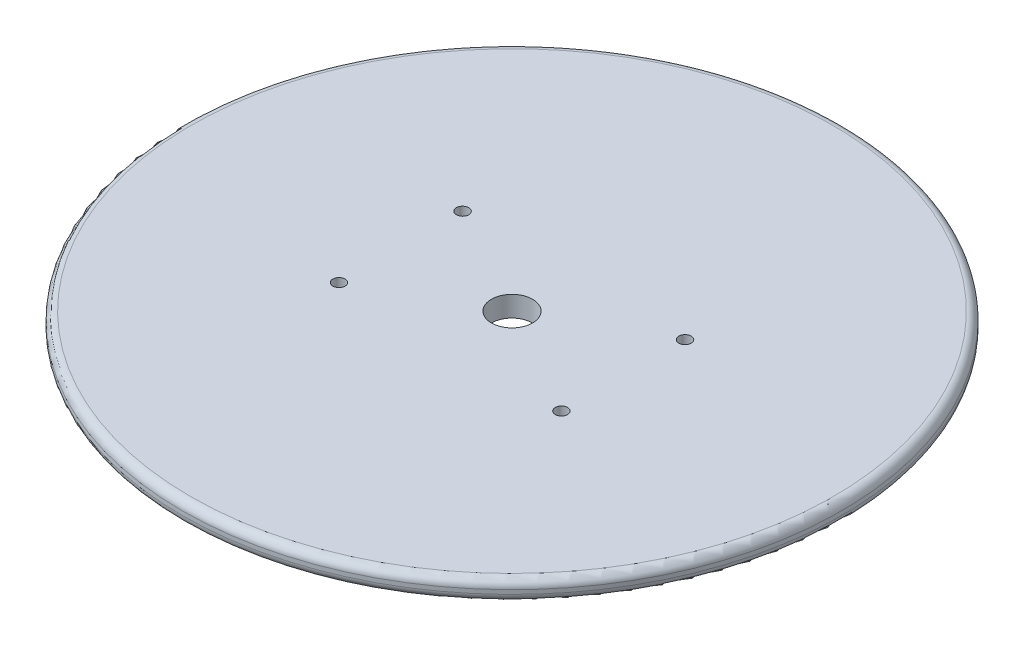
ISO-10303-21;
HEADER;
FILE_DESCRIPTION(('STEP AP214'),'2;1');
FILE_NAME('part.step','',(''),(''),'','','');
FILE_SCHEMA(('AUTOMOTIVE_DESIGN { 1 0 10303 214 1 1 1 1 }'));
ENDSEC;
DATA;
#1=APPLICATION_CONTEXT('core data for automotive mechanical design processes');
#2=APPLICATION_PROTOCOL_DEFINITION('international standard','automotive_design',2000,#1);
#3=PRODUCT_CONTEXT('',#1,'mechanical');
#4=PRODUCT('Part','Part','',(#3));
#5=PRODUCT_RELATED_PRODUCT_CATEGORY('part','',(#4));
#6=PRODUCT_DEFINITION_FORMATION('','',#4);
#7=PRODUCT_DEFINITION_CONTEXT('part definition',#1,'design');
#8=PRODUCT_DEFINITION('design','',#6,#7);
#9=PRODUCT_DEFINITION_SHAPE('','',#8);
#10=(LENGTH_UNIT() NAMED_UNIT(*) SI_UNIT(.MILLI.,.METRE.));
#11=(NAMED_UNIT(*) PLANE_ANGLE_UNIT() SI_UNIT($,.RADIAN.));
#12=(NAMED_UNIT(*) SI_UNIT($,.STERADIAN.) SOLID_ANGLE_UNIT());
#13=UNCERTAINTY_MEASURE_WITH_UNIT(LENGTH_MEASURE(1.E-05),#10,'distance_accuracy_value','');
#14=(GEOMETRIC_REPRESENTATION_CONTEXT(3) GLOBAL_UNCERTAINTY_ASSIGNED_CONTEXT((#13)) GLOBAL_UNIT_ASSIGNED_CONTEXT((#10,
#11,#12)) REPRESENTATION_CONTEXT('',''));
#15=CARTESIAN_POINT('',(0.,0.,0.));
#16=DIRECTION('',(0.,0.,1.));
#17=DIRECTION('',(1.,0.,0.));
#18=AXIS2_PLACEMENT_3D('',#15,#16,#17);
#19=CARTESIAN_POINT('',(0.,5.,0.));
#20=DIRECTION('',(0.,-1.,0.));
#21=DIRECTION('',(0.,0.,-1.));
#22=AXIS2_PLACEMENT_3D('',#19,#20,#21);
#23=CYLINDRICAL_SURFACE('',#22,80.);
#24=CARTESIAN_POINT('',(0.,2.,0.));
#25=DIRECTION('',(0.,1.,0.));
#26=DIRECTION('',(0.,0.,1.));
#27=AXIS2_PLACEMENT_3D('',#24,#25,#26);
#28=CIRCLE('',#27,80.);
#29=CARTESIAN_POINT('',(0.,2.,80.));
#30=VERTEX_POINT('',#29);
#31=EDGE_CURVE('E53',#30,#30,#28,.T.);
#32=ORIENTED_EDGE('',*,*,#31,.T.);
#33=EDGE_LOOP('',(#32));
#34=FACE_BOUND('',#33,.T.);
#35=CARTESIAN_POINT('',(0.,3.,0.));
#36=DIRECTION('',(0.,1.,0.));
#37=DIRECTION('',(0.,0.,1.));
#38=AXIS2_PLACEMENT_3D('',#35,#36,#37);
#39=CIRCLE('',#38,80.);
#40=CARTESIAN_POINT('',(0.,3.,80.));
#41=VERTEX_POINT('',#40);
#42=EDGE_CURVE('E58',#41,#41,#39,.F.);
#43=ORIENTED_EDGE('',*,*,#42,.T.);
#44=EDGE_LOOP('',(#43));
#45=FACE_BOUND('',#44,.T.);
#46=ADVANCED_FACE('F40',(#34,#45),#23,.T.);
#47=CARTESIAN_POINT('',(0.,5.,0.));
#48=DIRECTION('',(0.,1.,0.));
#49=DIRECTION('',(0.,0.,1.));
#50=AXIS2_PLACEMENT_3D('',#47,#48,#49);
#51=PLANE('',#50);
#52=CARTESIAN_POINT('',(27.,5.,-15.));
#53=DIRECTION('',(0.,1.,0.));
#54=DIRECTION('',(0.,0.,1.));
#55=AXIS2_PLACEMENT_3D('',#52,#53,#54);
#56=CIRCLE('',#55,1.5);
#57=CARTESIAN_POINT('',(27.,5.,-13.5));
#58=VERTEX_POINT('',#57);
#59=EDGE_CURVE('E81',#58,#58,#56,.T.);
#60=ORIENTED_EDGE('',*,*,#59,.F.);
#61=EDGE_LOOP('',(#60));
#62=FACE_BOUND('',#61,.T.);
#63=CARTESIAN_POINT('',(27.,5.,15.));
#64=DIRECTION('',(0.,1.,0.));
#65=DIRECTION('',(0.,0.,1.));
#66=AXIS2_PLACEMENT_3D('',#63,#64,#65);
#67=CIRCLE('',#66,1.5);
#68=CARTESIAN_POINT('',(27.,5.,16.5));
#69=VERTEX_POINT('',#68);
#70=EDGE_CURVE('E89',#69,#69,#67,.T.);
#71=ORIENTED_EDGE('',*,*,#70,.F.);
#72=EDGE_LOOP('',(#71));
#73=FACE_BOUND('',#72,.T.);
#74=CARTESIAN_POINT('',(-27.,5.,15.));
#75=DIRECTION('',(0.,1.,0.));
#76=DIRECTION('',(0.,0.,1.));
#77=AXIS2_PLACEMENT_3D('',#74,#75,#76);
#78=CIRCLE('',#77,1.5);
#79=CARTESIAN_POINT('',(-27.,5.,16.5));
#80=VERTEX_POINT('',#79);
#81=EDGE_CURVE('E97',#80,#80,#78,.T.);
#82=ORIENTED_EDGE('',*,*,#81,.F.);
#83=EDGE_LOOP('',(#82));
#84=FACE_BOUND('',#83,.T.);
#85=CARTESIAN_POINT('',(-27.,5.,-15.));
#86=DIRECTION('',(0.,1.,0.));
#87=DIRECTION('',(0.,0.,1.));
#88=AXIS2_PLACEMENT_3D('',#85,#86,#87);
#89=CIRCLE('',#88,1.5);
#90=CARTESIAN_POINT('',(-27.,5.,-13.5));
#91=VERTEX_POINT('',#90);
#92=EDGE_CURVE('E73',#91,#91,#89,.T.);
#93=ORIENTED_EDGE('',*,*,#92,.F.);
#94=EDGE_LOOP('',(#93));
#95=FACE_BOUND('',#94,.T.);
#96=CARTESIAN_POINT('',(0.,5.,0.));
#97=DIRECTION('',(0.,-1.,0.));
#98=DIRECTION('',(0.,0.,-1.));
#99=AXIS2_PLACEMENT_3D('',#96,#97,#98);
#100=CIRCLE('',#99,5.);
#101=CARTESIAN_POINT('',(0.,5.,-5.));
#102=VERTEX_POINT('',#101);
#103=EDGE_CURVE('E64',#102,#102,#100,.T.);
#104=ORIENTED_EDGE('',*,*,#103,.T.);
#105=EDGE_LOOP('',(#104));
#106=FACE_BOUND('',#105,.T.);
#107=CARTESIAN_POINT('',(0.,5.,0.));
#108=DIRECTION('',(0.,1.,0.));
#109=DIRECTION('',(0.,0.,1.));
#110=AXIS2_PLACEMENT_3D('',#107,#108,#109);
#111=CIRCLE('',#110,78.);
#112=CARTESIAN_POINT('',(0.,5.,78.));
#113=VERTEX_POINT('',#112);
#114=EDGE_CURVE('E10',#113,#113,#111,.T.);
#115=ORIENTED_EDGE('',*,*,#114,.T.);
#116=EDGE_LOOP('',(#115));
#117=FACE_BOUND('',#116,.T.);
#118=ADVANCED_FACE('F116',(#62,#73,#84,#95,#106,#117),#51,.T.);
#119=CARTESIAN_POINT('',(0.,0.,0.));
#120=DIRECTION('',(0.,1.,0.));
#121=DIRECTION('',(0.,0.,1.));
#122=AXIS2_PLACEMENT_3D('',#119,#120,#121);
#123=PLANE('',#122);
#124=CARTESIAN_POINT('',(27.,0.,-15.));
#125=DIRECTION('',(0.,1.,0.));
#126=DIRECTION('',(0.,0.,1.));
#127=AXIS2_PLACEMENT_3D('',#124,#125,#126);
#128=CIRCLE('',#127,1.5);
#129=CARTESIAN_POINT('',(27.,0.,-13.5));
#130=VERTEX_POINT('',#129);
#131=EDGE_CURVE('E85',#130,#130,#128,.T.);
#132=ORIENTED_EDGE('',*,*,#131,.T.);
#133=EDGE_LOOP('',(#132));
#134=FACE_BOUND('',#133,.T.);
#135=CARTESIAN_POINT('',(27.,0.,15.));
#136=DIRECTION('',(0.,1.,0.));
#137=DIRECTION('',(0.,0.,1.));
#138=AXIS2_PLACEMENT_3D('',#135,#136,#137);
#139=CIRCLE('',#138,1.5);
#140=CARTESIAN_POINT('',(27.,0.,16.5));
#141=VERTEX_POINT('',#140);
#142=EDGE_CURVE('E93',#141,#141,#139,.T.);
#143=ORIENTED_EDGE('',*,*,#142,.T.);
#144=EDGE_LOOP('',(#143));
#145=FACE_BOUND('',#144,.T.);
#146=CARTESIAN_POINT('',(-27.,0.,15.));
#147=DIRECTION('',(0.,1.,0.));
#148=DIRECTION('',(0.,0.,1.));
#149=AXIS2_PLACEMENT_3D('',#146,#147,#148);
#150=CIRCLE('',#149,1.5);
#151=CARTESIAN_POINT('',(-27.,0.,16.5));
#152=VERTEX_POINT('',#151);
#153=EDGE_CURVE('E77',#152,#152,#150,.T.);
#154=ORIENTED_EDGE('',*,*,#153,.T.);
#155=EDGE_LOOP('',(#154));
#156=FACE_BOUND('',#155,.T.);
#157=CARTESIAN_POINT('',(-27.,0.,-15.));
#158=DIRECTION('',(0.,1.,0.));
#159=DIRECTION('',(0.,0.,1.));
#160=AXIS2_PLACEMENT_3D('',#157,#158,#159);
#161=CIRCLE('',#160,1.5);
#162=CARTESIAN_POINT('',(-27.,0.,-13.5));
#163=VERTEX_POINT('',#162);
#164=EDGE_CURVE('E69',#163,#163,#161,.T.);
#165=ORIENTED_EDGE('',*,*,#164,.T.);
#166=EDGE_LOOP('',(#165));
#167=FACE_BOUND('',#166,.T.);
#168=CARTESIAN_POINT('',(0.,0.,0.));
#169=DIRECTION('',(0.,-1.,0.));
#170=DIRECTION('',(0.,0.,-1.));
#171=AXIS2_PLACEMENT_3D('',#168,#169,#170);
#172=CIRCLE('',#171,5.);
#173=CARTESIAN_POINT('',(0.,0.,-5.));
#174=VERTEX_POINT('',#173);
#175=EDGE_CURVE('E65',#174,#174,#172,.T.);
#176=ORIENTED_EDGE('',*,*,#175,.F.);
#177=EDGE_LOOP('',(#176));
#178=FACE_BOUND('',#177,.T.);
#179=CARTESIAN_POINT('',(0.,0.,0.));
#180=DIRECTION('',(0.,1.,0.));
#181=DIRECTION('',(0.,0.,1.));
#182=AXIS2_PLACEMENT_3D('',#179,#180,#181);
#183=CIRCLE('',#182,78.);
#184=CARTESIAN_POINT('',(0.,0.,78.));
#185=VERTEX_POINT('',#184);
#186=EDGE_CURVE('E48',#185,#185,#183,.F.);
#187=ORIENTED_EDGE('',*,*,#186,.T.);
#188=EDGE_LOOP('',(#187));
#189=FACE_BOUND('',#188,.T.);
#190=ADVANCED_FACE('F105',(#134,#145,#156,#167,#178,#189),#123,.F.);
#191=CARTESIAN_POINT('',(0.,2.,0.));
#192=DIRECTION('',(0.,1.,0.));
#193=DIRECTION('',(0.,0.,1.));
#194=AXIS2_PLACEMENT_3D('',#191,#192,#193);
#195=TOROIDAL_SURFACE('',#194,78.,2.);
#196=ORIENTED_EDGE('',*,*,#186,.F.);
#197=EDGE_LOOP('',(#196));
#198=FACE_BOUND('',#197,.T.);
#199=ORIENTED_EDGE('',*,*,#31,.F.);
#200=EDGE_LOOP('',(#199));
#201=FACE_BOUND('',#200,.T.);
#202=ADVANCED_FACE('F132',(#198,#201),#195,.T.);
#203=CARTESIAN_POINT('',(0.,3.,0.));
#204=DIRECTION('',(0.,1.,0.));
#205=DIRECTION('',(0.,0.,1.));
#206=AXIS2_PLACEMENT_3D('',#203,#204,#205);
#207=TOROIDAL_SURFACE('',#206,78.,2.);
#208=ORIENTED_EDGE('',*,*,#42,.F.);
#209=EDGE_LOOP('',(#208));
#210=FACE_BOUND('',#209,.T.);
#211=ORIENTED_EDGE('',*,*,#114,.F.);
#212=EDGE_LOOP('',(#211));
#213=FACE_BOUND('',#212,.T.);
#214=ADVANCED_FACE('F42',(#210,#213),#207,.T.);
#215=CARTESIAN_POINT('',(0.,5.,0.));
#216=DIRECTION('',(0.,-1.,0.));
#217=DIRECTION('',(0.,0.,-1.));
#218=AXIS2_PLACEMENT_3D('',#215,#216,#217);
#219=CYLINDRICAL_SURFACE('',#218,5.);
#220=ORIENTED_EDGE('',*,*,#103,.F.);
#221=EDGE_LOOP('',(#220));
#222=FACE_BOUND('',#221,.T.);
#223=ORIENTED_EDGE('',*,*,#175,.T.);
#224=EDGE_LOOP('',(#223));
#225=FACE_BOUND('',#224,.T.);
#226=ADVANCED_FACE('F125',(#222,#225),#219,.F.);
#227=CARTESIAN_POINT('',(-27.,0.,-15.));
#228=DIRECTION('',(0.,1.,0.));
#229=DIRECTION('',(0.,0.,1.));
#230=AXIS2_PLACEMENT_3D('',#227,#228,#229);
#231=CYLINDRICAL_SURFACE('',#230,1.5);
#232=ORIENTED_EDGE('',*,*,#164,.F.);
#233=EDGE_LOOP('',(#232));
#234=FACE_BOUND('',#233,.T.);
#235=ORIENTED_EDGE('',*,*,#92,.T.);
#236=EDGE_LOOP('',(#235));
#237=FACE_BOUND('',#236,.T.);
#238=ADVANCED_FACE('F112',(#234,#237),#231,.F.);
#239=CARTESIAN_POINT('',(-27.,0.,15.));
#240=DIRECTION('',(0.,1.,0.));
#241=DIRECTION('',(0.,0.,1.));
#242=AXIS2_PLACEMENT_3D('',#239,#240,#241);
#243=CYLINDRICAL_SURFACE('',#242,1.5);
#244=ORIENTED_EDGE('',*,*,#153,.F.);
#245=EDGE_LOOP('',(#244));
#246=FACE_BOUND('',#245,.T.);
#247=ORIENTED_EDGE('',*,*,#81,.T.);
#248=EDGE_LOOP('',(#247));
#249=FACE_BOUND('',#248,.T.);
#250=ADVANCED_FACE('F108',(#246,#249),#243,.F.);
#251=CARTESIAN_POINT('',(27.,0.,15.));
#252=DIRECTION('',(0.,1.,0.));
#253=DIRECTION('',(0.,0.,1.));
#254=AXIS2_PLACEMENT_3D('',#251,#252,#253);
#255=CYLINDRICAL_SURFACE('',#254,1.5);
#256=ORIENTED_EDGE('',*,*,#142,.F.);
#257=EDGE_LOOP('',(#256));
#258=FACE_BOUND('',#257,.T.);
#259=ORIENTED_EDGE('',*,*,#70,.T.);
#260=EDGE_LOOP('',(#259));
#261=FACE_BOUND('',#260,.T.);
#262=ADVANCED_FACE('F111',(#258,#261),#255,.F.);
#263=CARTESIAN_POINT('',(27.,0.,-15.));
#264=DIRECTION('',(0.,1.,0.));
#265=DIRECTION('',(0.,0.,1.));
#266=AXIS2_PLACEMENT_3D('',#263,#264,#265);
#267=CYLINDRICAL_SURFACE('',#266,1.5);
#268=ORIENTED_EDGE('',*,*,#131,.F.);
#269=EDGE_LOOP('',(#268));
#270=FACE_BOUND('',#269,.T.);
#271=ORIENTED_EDGE('',*,*,#59,.T.);
#272=EDGE_LOOP('',(#271));
#273=FACE_BOUND('',#272,.T.);
#274=ADVANCED_FACE('F177',(#270,#273),#267,.F.);
#275=CLOSED_SHELL('',(#46,#118,#190,#202,#214,#226,#238,#250,#262,#274));
#276=MANIFOLD_SOLID_BREP('B2',#275);
#277=ADVANCED_BREP_SHAPE_REPRESENTATION('',(#18,#276),#14);
#278=SHAPE_DEFINITION_REPRESENTATION(#9,#277);
ENDSEC;
END-ISO-10303-21;
